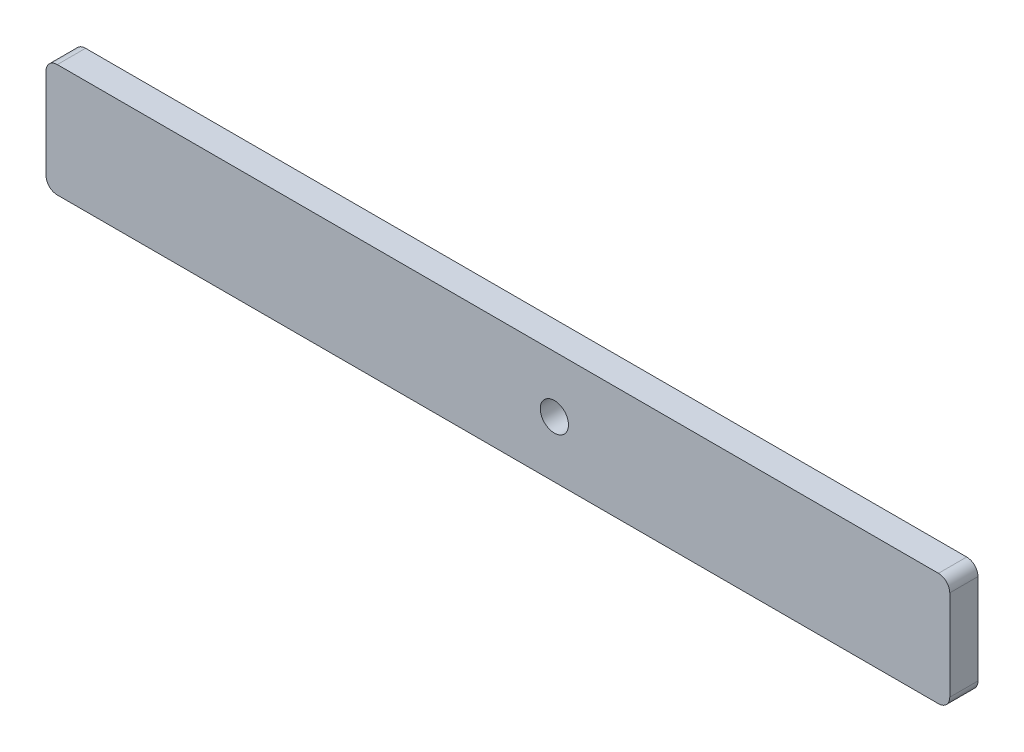
ISO-10303-21;
HEADER;
FILE_DESCRIPTION(('STEP AP214'),'2;1');
FILE_NAME('part.step','',(''),(''),'','','');
FILE_SCHEMA(('AUTOMOTIVE_DESIGN { 1 0 10303 214 1 1 1 1 }'));
ENDSEC;
DATA;
#1=APPLICATION_CONTEXT('core data for automotive mechanical design processes');
#2=APPLICATION_PROTOCOL_DEFINITION('international standard','automotive_design',2000,#1);
#3=PRODUCT_CONTEXT('',#1,'mechanical');
#4=PRODUCT('Part','Part','',(#3));
#5=PRODUCT_RELATED_PRODUCT_CATEGORY('part','',(#4));
#6=PRODUCT_DEFINITION_FORMATION('','',#4);
#7=PRODUCT_DEFINITION_CONTEXT('part definition',#1,'design');
#8=PRODUCT_DEFINITION('design','',#6,#7);
#9=PRODUCT_DEFINITION_SHAPE('','',#8);
#10=(LENGTH_UNIT() NAMED_UNIT(*) SI_UNIT(.MILLI.,.METRE.));
#11=(NAMED_UNIT(*) PLANE_ANGLE_UNIT() SI_UNIT($,.RADIAN.));
#12=(NAMED_UNIT(*) SI_UNIT($,.STERADIAN.) SOLID_ANGLE_UNIT());
#13=UNCERTAINTY_MEASURE_WITH_UNIT(LENGTH_MEASURE(1.E-05),#10,'distance_accuracy_value','');
#14=(GEOMETRIC_REPRESENTATION_CONTEXT(3) GLOBAL_UNCERTAINTY_ASSIGNED_CONTEXT((#13)) GLOBAL_UNIT_ASSIGNED_CONTEXT((#10,
#11,#12)) REPRESENTATION_CONTEXT('',''));
#15=CARTESIAN_POINT('',(0.,0.,0.));
#16=DIRECTION('',(0.,0.,1.));
#17=DIRECTION('',(1.,0.,0.));
#18=AXIS2_PLACEMENT_3D('',#15,#16,#17);
#19=CARTESIAN_POINT('',(99.06,-10.16,6.35));
#20=DIRECTION('',(0.,0.,1.));
#21=DIRECTION('',(1.,0.,0.));
#22=AXIS2_PLACEMENT_3D('',#19,#20,#21);
#23=PLANE('',#22);
#24=CARTESIAN_POINT('',(99.06,-10.16,6.35));
#25=DIRECTION('',(0.,0.,1.));
#26=DIRECTION('',(1.,0.,0.));
#27=AXIS2_PLACEMENT_3D('',#24,#25,#26);
#28=CIRCLE('',#27,2.54000000000001);
#29=CARTESIAN_POINT('',(99.06,-12.7,6.35));
#30=VERTEX_POINT('',#29);
#31=CARTESIAN_POINT('',(101.6,-10.16,6.35));
#32=VERTEX_POINT('',#31);
#33=EDGE_CURVE('E145',#30,#32,#28,.T.);
#34=ORIENTED_EDGE('',*,*,#33,.T.);
#35=DIRECTION('',(0.,1.,0.));
#36=VECTOR('',#35,1.);
#37=CARTESIAN_POINT('',(101.6,10.16,6.35));
#38=LINE('',#37,#36);
#39=CARTESIAN_POINT('',(101.6,10.16,6.35));
#40=VERTEX_POINT('',#39);
#41=EDGE_CURVE('E93',#32,#40,#38,.T.);
#42=ORIENTED_EDGE('',*,*,#41,.T.);
#43=CARTESIAN_POINT('',(99.06,10.16,6.35));
#44=DIRECTION('',(0.,0.,1.));
#45=DIRECTION('',(-1.,0.,0.));
#46=AXIS2_PLACEMENT_3D('',#43,#44,#45);
#47=CIRCLE('',#46,2.54000000000001);
#48=CARTESIAN_POINT('',(99.06,12.7,6.35));
#49=VERTEX_POINT('',#48);
#50=EDGE_CURVE('E160',#40,#49,#47,.T.);
#51=ORIENTED_EDGE('',*,*,#50,.T.);
#52=DIRECTION('',(-1.,0.,0.));
#53=VECTOR('',#52,1.);
#54=CARTESIAN_POINT('',(-99.06,12.7,6.35));
#55=LINE('',#54,#53);
#56=CARTESIAN_POINT('',(-99.06,12.7,6.35));
#57=VERTEX_POINT('',#56);
#58=EDGE_CURVE('E173',#49,#57,#55,.T.);
#59=ORIENTED_EDGE('',*,*,#58,.T.);
#60=CARTESIAN_POINT('',(-99.06,10.16,6.35));
#61=DIRECTION('',(0.,0.,1.));
#62=DIRECTION('',(1.,0.,0.));
#63=AXIS2_PLACEMENT_3D('',#60,#61,#62);
#64=CIRCLE('',#63,2.54000000000001);
#65=CARTESIAN_POINT('',(-101.6,10.16,6.35));
#66=VERTEX_POINT('',#65);
#67=EDGE_CURVE('E112',#57,#66,#64,.T.);
#68=ORIENTED_EDGE('',*,*,#67,.T.);
#69=DIRECTION('',(0.,-1.,0.));
#70=VECTOR('',#69,1.);
#71=CARTESIAN_POINT('',(-101.6,10.16,6.35));
#72=LINE('',#71,#70);
#73=CARTESIAN_POINT('',(-101.6,-10.16,6.35));
#74=VERTEX_POINT('',#73);
#75=EDGE_CURVE('E106',#66,#74,#72,.T.);
#76=ORIENTED_EDGE('',*,*,#75,.T.);
#77=CARTESIAN_POINT('',(-99.06,-10.16,6.35));
#78=DIRECTION('',(0.,0.,1.));
#79=DIRECTION('',(1.,0.,0.));
#80=AXIS2_PLACEMENT_3D('',#77,#78,#79);
#81=CIRCLE('',#80,2.54000000000001);
#82=CARTESIAN_POINT('',(-99.06,-12.7,6.35));
#83=VERTEX_POINT('',#82);
#84=EDGE_CURVE('E110',#74,#83,#81,.T.);
#85=ORIENTED_EDGE('',*,*,#84,.T.);
#86=DIRECTION('',(1.,0.,0.));
#87=VECTOR('',#86,1.);
#88=CARTESIAN_POINT('',(-99.06,-12.7,6.35));
#89=LINE('',#88,#87);
#90=EDGE_CURVE('E50',#83,#30,#89,.T.);
#91=ORIENTED_EDGE('',*,*,#90,.T.);
#92=EDGE_LOOP('',(#34,#42,#51,#59,#68,#76,#85,#91));
#93=FACE_BOUND('',#92,.T.);
#94=CARTESIAN_POINT('',(12.7,0.,6.35));
#95=DIRECTION('',(0.,0.,1.));
#96=DIRECTION('',(1.,0.,0.));
#97=AXIS2_PLACEMENT_3D('',#94,#95,#96);
#98=CIRCLE('',#97,3.175);
#99=CARTESIAN_POINT('',(15.875,0.,6.35));
#100=VERTEX_POINT('',#99);
#101=EDGE_CURVE('E134',#100,#100,#98,.T.);
#102=ORIENTED_EDGE('',*,*,#101,.F.);
#103=EDGE_LOOP('',(#102));
#104=FACE_BOUND('',#103,.T.);
#105=ADVANCED_FACE('F33',(#93,#104),#23,.T.);
#106=CARTESIAN_POINT('',(99.06,-10.16,0.));
#107=DIRECTION('',(0.,0.,1.));
#108=DIRECTION('',(1.,0.,0.));
#109=AXIS2_PLACEMENT_3D('',#106,#107,#108);
#110=PLANE('',#109);
#111=CARTESIAN_POINT('',(99.06,-10.16,0.));
#112=DIRECTION('',(0.,0.,1.));
#113=DIRECTION('',(1.,0.,0.));
#114=AXIS2_PLACEMENT_3D('',#111,#112,#113);
#115=CIRCLE('',#114,2.54000000000001);
#116=CARTESIAN_POINT('',(99.06,-12.7,0.));
#117=VERTEX_POINT('',#116);
#118=CARTESIAN_POINT('',(101.6,-10.16,0.));
#119=VERTEX_POINT('',#118);
#120=EDGE_CURVE('E130',#117,#119,#115,.T.);
#121=ORIENTED_EDGE('',*,*,#120,.F.);
#122=DIRECTION('',(1.,0.,0.));
#123=VECTOR('',#122,1.);
#124=CARTESIAN_POINT('',(-99.06,-12.7,0.));
#125=LINE('',#124,#123);
#126=CARTESIAN_POINT('',(-99.06,-12.7,0.));
#127=VERTEX_POINT('',#126);
#128=EDGE_CURVE('E85',#127,#117,#125,.T.);
#129=ORIENTED_EDGE('',*,*,#128,.F.);
#130=CARTESIAN_POINT('',(-99.06,-10.16,0.));
#131=DIRECTION('',(0.,0.,1.));
#132=DIRECTION('',(1.,0.,0.));
#133=AXIS2_PLACEMENT_3D('',#130,#131,#132);
#134=CIRCLE('',#133,2.54000000000001);
#135=CARTESIAN_POINT('',(-101.6,-10.16,0.));
#136=VERTEX_POINT('',#135);
#137=EDGE_CURVE('E79',#136,#127,#134,.T.);
#138=ORIENTED_EDGE('',*,*,#137,.F.);
#139=DIRECTION('',(0.,-1.,0.));
#140=VECTOR('',#139,1.);
#141=CARTESIAN_POINT('',(-101.6,10.16,0.));
#142=LINE('',#141,#140);
#143=CARTESIAN_POINT('',(-101.6,10.16,0.));
#144=VERTEX_POINT('',#143);
#145=EDGE_CURVE('E120',#144,#136,#142,.T.);
#146=ORIENTED_EDGE('',*,*,#145,.F.);
#147=CARTESIAN_POINT('',(-99.06,10.16,0.));
#148=DIRECTION('',(0.,0.,1.));
#149=DIRECTION('',(1.,0.,0.));
#150=AXIS2_PLACEMENT_3D('',#147,#148,#149);
#151=CIRCLE('',#150,2.54000000000001);
#152=CARTESIAN_POINT('',(-99.06,12.7,0.));
#153=VERTEX_POINT('',#152);
#154=EDGE_CURVE('E140',#153,#144,#151,.T.);
#155=ORIENTED_EDGE('',*,*,#154,.F.);
#156=DIRECTION('',(-1.,0.,0.));
#157=VECTOR('',#156,1.);
#158=CARTESIAN_POINT('',(-99.06,12.7,0.));
#159=LINE('',#158,#157);
#160=CARTESIAN_POINT('',(99.06,12.7,0.));
#161=VERTEX_POINT('',#160);
#162=EDGE_CURVE('E138',#161,#153,#159,.T.);
#163=ORIENTED_EDGE('',*,*,#162,.F.);
#164=CARTESIAN_POINT('',(99.06,10.16,0.));
#165=DIRECTION('',(0.,0.,1.));
#166=DIRECTION('',(-1.,0.,0.));
#167=AXIS2_PLACEMENT_3D('',#164,#165,#166);
#168=CIRCLE('',#167,2.54000000000001);
#169=CARTESIAN_POINT('',(101.6,10.16,0.));
#170=VERTEX_POINT('',#169);
#171=EDGE_CURVE('E136',#170,#161,#168,.T.);
#172=ORIENTED_EDGE('',*,*,#171,.F.);
#173=DIRECTION('',(0.,1.,0.));
#174=VECTOR('',#173,1.);
#175=CARTESIAN_POINT('',(101.6,10.16,0.));
#176=LINE('',#175,#174);
#177=EDGE_CURVE('E133',#119,#170,#176,.T.);
#178=ORIENTED_EDGE('',*,*,#177,.F.);
#179=EDGE_LOOP('',(#121,#129,#138,#146,#155,#163,#172,#178));
#180=FACE_BOUND('',#179,.T.);
#181=CARTESIAN_POINT('',(12.7,0.,0.));
#182=DIRECTION('',(0.,0.,1.));
#183=DIRECTION('',(1.,0.,0.));
#184=AXIS2_PLACEMENT_3D('',#181,#182,#183);
#185=CIRCLE('',#184,3.175);
#186=CARTESIAN_POINT('',(15.875,0.,0.));
#187=VERTEX_POINT('',#186);
#188=EDGE_CURVE('E179',#187,#187,#185,.T.);
#189=ORIENTED_EDGE('',*,*,#188,.T.);
#190=EDGE_LOOP('',(#189));
#191=FACE_BOUND('',#190,.T.);
#192=ADVANCED_FACE('F164',(#180,#191),#110,.F.);
#193=CARTESIAN_POINT('',(99.06,-10.16,6.35));
#194=DIRECTION('',(0.,0.,-1.));
#195=DIRECTION('',(-1.,0.,0.));
#196=AXIS2_PLACEMENT_3D('',#193,#194,#195);
#197=CYLINDRICAL_SURFACE('',#196,2.54000000000001);
#198=ORIENTED_EDGE('',*,*,#120,.T.);
#199=DIRECTION('',(0.,0.,-1.));
#200=VECTOR('',#199,1.);
#201=CARTESIAN_POINT('',(101.6,-10.16,6.35));
#202=LINE('',#201,#200);
#203=EDGE_CURVE('E11',#32,#119,#202,.T.);
#204=ORIENTED_EDGE('',*,*,#203,.F.);
#205=ORIENTED_EDGE('',*,*,#33,.F.);
#206=DIRECTION('',(0.,0.,-1.));
#207=VECTOR('',#206,1.);
#208=CARTESIAN_POINT('',(99.06,-12.7,6.35));
#209=LINE('',#208,#207);
#210=EDGE_CURVE('E126',#30,#117,#209,.T.);
#211=ORIENTED_EDGE('',*,*,#210,.T.);
#212=EDGE_LOOP('',(#198,#204,#205,#211));
#213=FACE_BOUND('',#212,.T.);
#214=ADVANCED_FACE('F35',(#213),#197,.T.);
#215=CARTESIAN_POINT('',(101.6,10.16,6.35));
#216=DIRECTION('',(-1.,0.,0.));
#217=DIRECTION('',(0.,0.,1.));
#218=AXIS2_PLACEMENT_3D('',#215,#216,#217);
#219=PLANE('',#218);
#220=ORIENTED_EDGE('',*,*,#177,.T.);
#221=DIRECTION('',(0.,0.,-1.));
#222=VECTOR('',#221,1.);
#223=CARTESIAN_POINT('',(101.6,10.16,6.35));
#224=LINE('',#223,#222);
#225=EDGE_CURVE('E42',#40,#170,#224,.T.);
#226=ORIENTED_EDGE('',*,*,#225,.F.);
#227=ORIENTED_EDGE('',*,*,#41,.F.);
#228=ORIENTED_EDGE('',*,*,#203,.T.);
#229=EDGE_LOOP('',(#220,#226,#227,#228));
#230=FACE_BOUND('',#229,.T.);
#231=ADVANCED_FACE('F207',(#230),#219,.F.);
#232=CARTESIAN_POINT('',(99.06,10.16,6.35));
#233=DIRECTION('',(0.,0.,-1.));
#234=DIRECTION('',(-1.,0.,0.));
#235=AXIS2_PLACEMENT_3D('',#232,#233,#234);
#236=CYLINDRICAL_SURFACE('',#235,2.54000000000001);
#237=ORIENTED_EDGE('',*,*,#171,.T.);
#238=DIRECTION('',(0.,0.,-1.));
#239=VECTOR('',#238,1.);
#240=CARTESIAN_POINT('',(99.06,12.7,6.35));
#241=LINE('',#240,#239);
#242=EDGE_CURVE('E152',#49,#161,#241,.T.);
#243=ORIENTED_EDGE('',*,*,#242,.F.);
#244=ORIENTED_EDGE('',*,*,#50,.F.);
#245=ORIENTED_EDGE('',*,*,#225,.T.);
#246=EDGE_LOOP('',(#237,#243,#244,#245));
#247=FACE_BOUND('',#246,.T.);
#248=ADVANCED_FACE('F158',(#247),#236,.T.);
#249=CARTESIAN_POINT('',(-99.06,12.7,6.35));
#250=DIRECTION('',(0.,-1.,0.));
#251=DIRECTION('',(0.,0.,-1.));
#252=AXIS2_PLACEMENT_3D('',#249,#250,#251);
#253=PLANE('',#252);
#254=ORIENTED_EDGE('',*,*,#162,.T.);
#255=DIRECTION('',(0.,0.,-1.));
#256=VECTOR('',#255,1.);
#257=CARTESIAN_POINT('',(-99.06,12.7,6.35));
#258=LINE('',#257,#256);
#259=EDGE_CURVE('E149',#57,#153,#258,.T.);
#260=ORIENTED_EDGE('',*,*,#259,.F.);
#261=ORIENTED_EDGE('',*,*,#58,.F.);
#262=ORIENTED_EDGE('',*,*,#242,.T.);
#263=EDGE_LOOP('',(#254,#260,#261,#262));
#264=FACE_BOUND('',#263,.T.);
#265=ADVANCED_FACE('F169',(#264),#253,.F.);
#266=CARTESIAN_POINT('',(-99.06,10.16,6.35));
#267=DIRECTION('',(0.,0.,-1.));
#268=DIRECTION('',(-1.,0.,0.));
#269=AXIS2_PLACEMENT_3D('',#266,#267,#268);
#270=CYLINDRICAL_SURFACE('',#269,2.54000000000001);
#271=ORIENTED_EDGE('',*,*,#154,.T.);
#272=DIRECTION('',(0.,0.,-1.));
#273=VECTOR('',#272,1.);
#274=CARTESIAN_POINT('',(-101.6,10.16,6.35));
#275=LINE('',#274,#273);
#276=EDGE_CURVE('E121',#66,#144,#275,.T.);
#277=ORIENTED_EDGE('',*,*,#276,.F.);
#278=ORIENTED_EDGE('',*,*,#67,.F.);
#279=ORIENTED_EDGE('',*,*,#259,.T.);
#280=EDGE_LOOP('',(#271,#277,#278,#279));
#281=FACE_BOUND('',#280,.T.);
#282=ADVANCED_FACE('F172',(#281),#270,.T.);
#283=CARTESIAN_POINT('',(-101.6,10.16,6.35));
#284=DIRECTION('',(1.,0.,0.));
#285=DIRECTION('',(0.,0.,-1.));
#286=AXIS2_PLACEMENT_3D('',#283,#284,#285);
#287=PLANE('',#286);
#288=ORIENTED_EDGE('',*,*,#145,.T.);
#289=DIRECTION('',(0.,0.,-1.));
#290=VECTOR('',#289,1.);
#291=CARTESIAN_POINT('',(-101.6,-10.16,6.35));
#292=LINE('',#291,#290);
#293=EDGE_CURVE('E117',#74,#136,#292,.T.);
#294=ORIENTED_EDGE('',*,*,#293,.F.);
#295=ORIENTED_EDGE('',*,*,#75,.F.);
#296=ORIENTED_EDGE('',*,*,#276,.T.);
#297=EDGE_LOOP('',(#288,#294,#295,#296));
#298=FACE_BOUND('',#297,.T.);
#299=ADVANCED_FACE('F118',(#298),#287,.F.);
#300=CARTESIAN_POINT('',(-99.06,-10.16,6.35));
#301=DIRECTION('',(0.,0.,-1.));
#302=DIRECTION('',(-1.,0.,0.));
#303=AXIS2_PLACEMENT_3D('',#300,#301,#302);
#304=CYLINDRICAL_SURFACE('',#303,2.54000000000001);
#305=ORIENTED_EDGE('',*,*,#137,.T.);
#306=DIRECTION('',(0.,0.,-1.));
#307=VECTOR('',#306,1.);
#308=CARTESIAN_POINT('',(-99.06,-12.7,6.35));
#309=LINE('',#308,#307);
#310=EDGE_CURVE('E122',#83,#127,#309,.T.);
#311=ORIENTED_EDGE('',*,*,#310,.F.);
#312=ORIENTED_EDGE('',*,*,#84,.F.);
#313=ORIENTED_EDGE('',*,*,#293,.T.);
#314=EDGE_LOOP('',(#305,#311,#312,#313));
#315=FACE_BOUND('',#314,.T.);
#316=ADVANCED_FACE('F124',(#315),#304,.T.);
#317=CARTESIAN_POINT('',(-99.06,-12.7,6.35));
#318=DIRECTION('',(0.,1.,0.));
#319=DIRECTION('',(0.,0.,1.));
#320=AXIS2_PLACEMENT_3D('',#317,#318,#319);
#321=PLANE('',#320);
#322=ORIENTED_EDGE('',*,*,#128,.T.);
#323=ORIENTED_EDGE('',*,*,#210,.F.);
#324=ORIENTED_EDGE('',*,*,#90,.F.);
#325=ORIENTED_EDGE('',*,*,#310,.T.);
#326=EDGE_LOOP('',(#322,#323,#324,#325));
#327=FACE_BOUND('',#326,.T.);
#328=ADVANCED_FACE('F195',(#327),#321,.F.);
#329=CARTESIAN_POINT('',(12.7,0.,6.35));
#330=DIRECTION('',(0.,0.,-1.));
#331=DIRECTION('',(-1.,0.,0.));
#332=AXIS2_PLACEMENT_3D('',#329,#330,#331);
#333=CYLINDRICAL_SURFACE('',#332,3.175);
#334=ORIENTED_EDGE('',*,*,#101,.T.);
#335=EDGE_LOOP('',(#334));
#336=FACE_BOUND('',#335,.T.);
#337=ORIENTED_EDGE('',*,*,#188,.F.);
#338=EDGE_LOOP('',(#337));
#339=FACE_BOUND('',#338,.T.);
#340=ADVANCED_FACE('F185',(#336,#339),#333,.F.);
#341=CLOSED_SHELL('',(#105,#192,#214,#231,#248,#265,#282,#299,#316,#328,#340));
#342=MANIFOLD_SOLID_BREP('B2',#341);
#343=ADVANCED_BREP_SHAPE_REPRESENTATION('',(#18,#342),#14);
#344=SHAPE_DEFINITION_REPRESENTATION(#9,#343);
ENDSEC;
END-ISO-10303-21;
